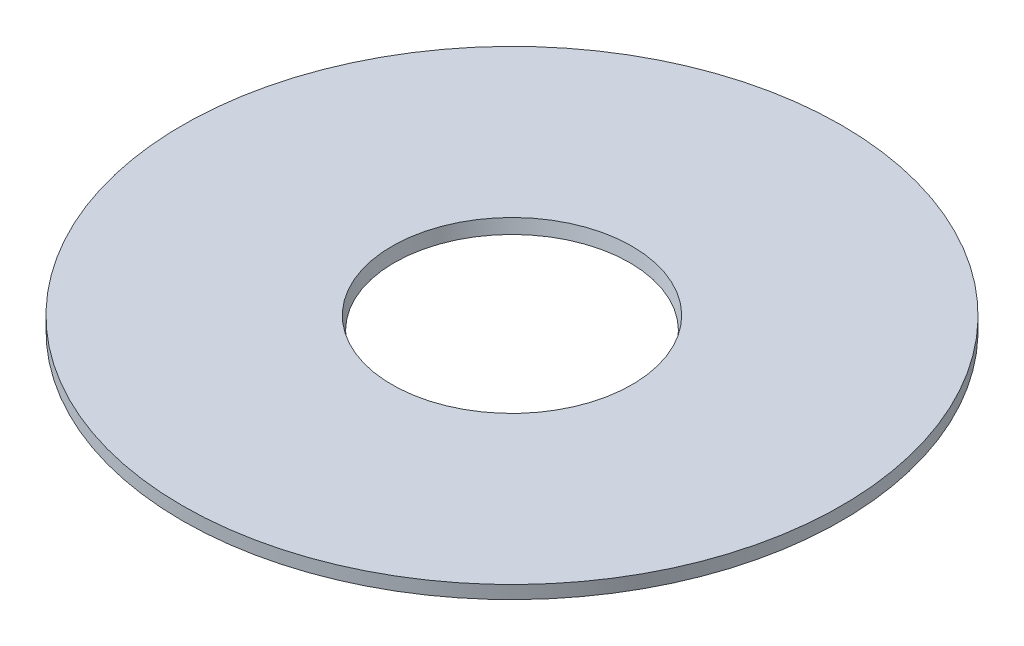
ISO-10303-21;
HEADER;
FILE_DESCRIPTION(('STEP AP214'),'2;1');
FILE_NAME('part.step','',(''),(''),'','','');
FILE_SCHEMA(('AUTOMOTIVE_DESIGN { 1 0 10303 214 1 1 1 1 }'));
ENDSEC;
DATA;
#1=APPLICATION_CONTEXT('core data for automotive mechanical design processes');
#2=APPLICATION_PROTOCOL_DEFINITION('international standard','automotive_design',2000,#1);
#3=PRODUCT_CONTEXT('',#1,'mechanical');
#4=PRODUCT('Part','Part','',(#3));
#5=PRODUCT_RELATED_PRODUCT_CATEGORY('part','',(#4));
#6=PRODUCT_DEFINITION_FORMATION('','',#4);
#7=PRODUCT_DEFINITION_CONTEXT('part definition',#1,'design');
#8=PRODUCT_DEFINITION('design','',#6,#7);
#9=PRODUCT_DEFINITION_SHAPE('','',#8);
#10=(LENGTH_UNIT() NAMED_UNIT(*) SI_UNIT(.MILLI.,.METRE.));
#11=(NAMED_UNIT(*) PLANE_ANGLE_UNIT() SI_UNIT($,.RADIAN.));
#12=(NAMED_UNIT(*) SI_UNIT($,.STERADIAN.) SOLID_ANGLE_UNIT());
#13=UNCERTAINTY_MEASURE_WITH_UNIT(LENGTH_MEASURE(1.E-05),#10,'distance_accuracy_value','');
#14=(GEOMETRIC_REPRESENTATION_CONTEXT(3) GLOBAL_UNCERTAINTY_ASSIGNED_CONTEXT((#13)) GLOBAL_UNIT_ASSIGNED_CONTEXT((#10,
#11,#12)) REPRESENTATION_CONTEXT('',''));
#15=CARTESIAN_POINT('',(0.,0.,0.));
#16=DIRECTION('',(0.,0.,1.));
#17=DIRECTION('',(1.,0.,0.));
#18=AXIS2_PLACEMENT_3D('',#15,#16,#17);
#19=CARTESIAN_POINT('',(0.,0.,0.));
#20=DIRECTION('',(0.,1.,0.));
#21=DIRECTION('',(0.,0.,1.));
#22=AXIS2_PLACEMENT_3D('',#19,#20,#21);
#23=CONICAL_SURFACE('',#22,45.8816349035423,0.174532925199433);
#24=CARTESIAN_POINT('',(0.,-4.99999999999999,0.));
#25=DIRECTION('',(0.,-1.,0.));
#26=DIRECTION('',(0.,0.,-1.));
#27=AXIS2_PLACEMENT_3D('',#24,#25,#26);
#28=CIRCLE('',#27,45.);
#29=CARTESIAN_POINT('',(0.,-4.99999999999999,-45.));
#30=VERTEX_POINT('',#29);
#31=EDGE_CURVE('E10',#30,#30,#28,.T.);
#32=ORIENTED_EDGE('',*,*,#31,.T.);
#33=EDGE_LOOP('',(#32));
#34=FACE_BOUND('',#33,.T.);
#35=CARTESIAN_POINT('',(0.,0.,0.));
#36=DIRECTION('',(0.,-1.,0.));
#37=DIRECTION('',(0.,0.,-1.));
#38=AXIS2_PLACEMENT_3D('',#35,#36,#37);
#39=CIRCLE('',#38,45.8816349035423);
#40=CARTESIAN_POINT('',(0.,0.,-45.8816349035423));
#41=VERTEX_POINT('',#40);
#42=EDGE_CURVE('E49',#41,#41,#39,.T.);
#43=ORIENTED_EDGE('',*,*,#42,.F.);
#44=EDGE_LOOP('',(#43));
#45=FACE_BOUND('',#44,.T.);
#46=ADVANCED_FACE('F35',(#34,#45),#23,.F.);
#47=CARTESIAN_POINT('',(45.8816349035423,-4.99999999999999,0.));
#48=DIRECTION('',(0.,-1.,0.));
#49=DIRECTION('',(0.,0.,-1.));
#50=AXIS2_PLACEMENT_3D('',#47,#48,#49);
#51=PLANE('',#50);
#52=CARTESIAN_POINT('',(0.,-4.99999999999999,0.));
#53=DIRECTION('',(0.,-1.,0.));
#54=DIRECTION('',(0.,0.,-1.));
#55=AXIS2_PLACEMENT_3D('',#52,#53,#54);
#56=CIRCLE('',#55,126.);
#57=CARTESIAN_POINT('',(0.,-4.99999999999999,-126.));
#58=VERTEX_POINT('',#57);
#59=EDGE_CURVE('E41',#58,#58,#56,.T.);
#60=ORIENTED_EDGE('',*,*,#59,.T.);
#61=EDGE_LOOP('',(#60));
#62=FACE_BOUND('',#61,.T.);
#63=ORIENTED_EDGE('',*,*,#31,.F.);
#64=EDGE_LOOP('',(#63));
#65=FACE_BOUND('',#64,.T.);
#66=ADVANCED_FACE('F59',(#62,#65),#51,.T.);
#67=CARTESIAN_POINT('',(0.,0.,0.));
#68=DIRECTION('',(0.,-1.,0.));
#69=DIRECTION('',(0.,0.,-1.));
#70=AXIS2_PLACEMENT_3D('',#67,#68,#69);
#71=CYLINDRICAL_SURFACE('',#70,126.);
#72=CARTESIAN_POINT('',(0.,0.,0.));
#73=DIRECTION('',(0.,-1.,0.));
#74=DIRECTION('',(0.,0.,-1.));
#75=AXIS2_PLACEMENT_3D('',#72,#73,#74);
#76=CIRCLE('',#75,126.);
#77=CARTESIAN_POINT('',(0.,0.,-126.));
#78=VERTEX_POINT('',#77);
#79=EDGE_CURVE('E45',#78,#78,#76,.T.);
#80=ORIENTED_EDGE('',*,*,#79,.T.);
#81=EDGE_LOOP('',(#80));
#82=FACE_BOUND('',#81,.T.);
#83=ORIENTED_EDGE('',*,*,#59,.F.);
#84=EDGE_LOOP('',(#83));
#85=FACE_BOUND('',#84,.T.);
#86=ADVANCED_FACE('F63',(#82,#85),#71,.T.);
#87=CARTESIAN_POINT('',(126.,0.,0.));
#88=DIRECTION('',(0.,1.,0.));
#89=DIRECTION('',(0.,0.,1.));
#90=AXIS2_PLACEMENT_3D('',#87,#88,#89);
#91=PLANE('',#90);
#92=ORIENTED_EDGE('',*,*,#42,.T.);
#93=EDGE_LOOP('',(#92));
#94=FACE_BOUND('',#93,.T.);
#95=ORIENTED_EDGE('',*,*,#79,.F.);
#96=EDGE_LOOP('',(#95));
#97=FACE_BOUND('',#96,.T.);
#98=ADVANCED_FACE('F55',(#94,#97),#91,.T.);
#99=CLOSED_SHELL('',(#46,#66,#86,#98));
#100=MANIFOLD_SOLID_BREP('B2',#99);
#101=ADVANCED_BREP_SHAPE_REPRESENTATION('',(#18,#100),#14);
#102=SHAPE_DEFINITION_REPRESENTATION(#9,#101);
ENDSEC;
END-ISO-10303-21;
